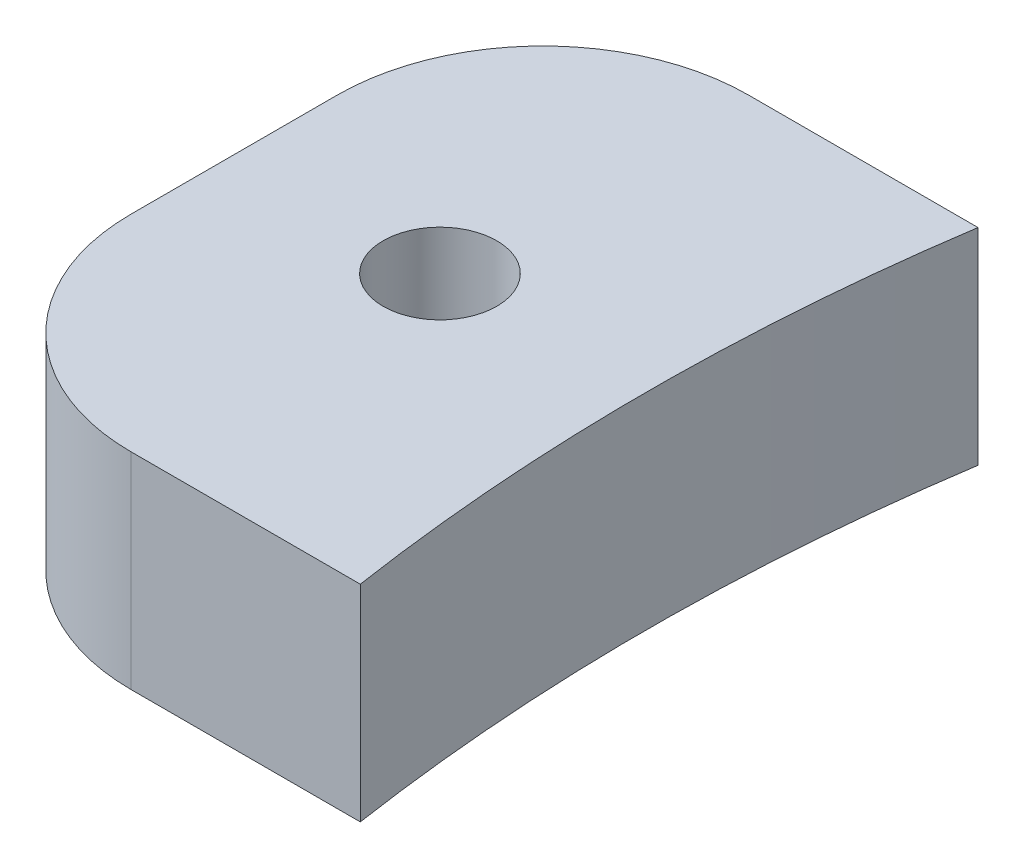
ISO-10303-21;
HEADER;
FILE_DESCRIPTION(('STEP AP214'),'2;1');
FILE_NAME('part.step','',(''),(''),'','','');
FILE_SCHEMA(('AUTOMOTIVE_DESIGN { 1 0 10303 214 1 1 1 1 }'));
ENDSEC;
DATA;
#1=APPLICATION_CONTEXT('core data for automotive mechanical design processes');
#2=APPLICATION_PROTOCOL_DEFINITION('international standard','automotive_design',2000,#1);
#3=PRODUCT_CONTEXT('',#1,'mechanical');
#4=PRODUCT('Part','Part','',(#3));
#5=PRODUCT_RELATED_PRODUCT_CATEGORY('part','',(#4));
#6=PRODUCT_DEFINITION_FORMATION('','',#4);
#7=PRODUCT_DEFINITION_CONTEXT('part definition',#1,'design');
#8=PRODUCT_DEFINITION('design','',#6,#7);
#9=PRODUCT_DEFINITION_SHAPE('','',#8);
#10=(LENGTH_UNIT() NAMED_UNIT(*) SI_UNIT(.MILLI.,.METRE.));
#11=(NAMED_UNIT(*) PLANE_ANGLE_UNIT() SI_UNIT($,.RADIAN.));
#12=(NAMED_UNIT(*) SI_UNIT($,.STERADIAN.) SOLID_ANGLE_UNIT());
#13=UNCERTAINTY_MEASURE_WITH_UNIT(LENGTH_MEASURE(1.E-05),#10,'distance_accuracy_value','');
#14=(GEOMETRIC_REPRESENTATION_CONTEXT(3) GLOBAL_UNCERTAINTY_ASSIGNED_CONTEXT((#13)) GLOBAL_UNIT_ASSIGNED_CONTEXT((#10,
#11,#12)) REPRESENTATION_CONTEXT('',''));
#15=CARTESIAN_POINT('',(0.,0.,0.));
#16=DIRECTION('',(0.,0.,1.));
#17=DIRECTION('',(1.,0.,0.));
#18=AXIS2_PLACEMENT_3D('',#15,#16,#17);
#19=CARTESIAN_POINT('',(-69.85,6.35,-9.525));
#20=DIRECTION('',(0.,0.,1.));
#21=DIRECTION('',(1.,0.,0.));
#22=AXIS2_PLACEMENT_3D('',#19,#20,#21);
#23=PLANE('',#22);
#24=DIRECTION('',(-1.,0.,0.));
#25=VECTOR('',#24,1.);
#26=CARTESIAN_POINT('',(-69.85,6.35,-9.525));
#27=LINE('',#26,#25);
#28=CARTESIAN_POINT('',(-62.7815607881805,6.35,-9.525));
#29=VERTEX_POINT('',#28);
#30=CARTESIAN_POINT('',(-69.85,6.35,-9.52499999999998));
#31=VERTEX_POINT('',#30);
#32=EDGE_CURVE('E100',#29,#31,#27,.T.);
#33=ORIENTED_EDGE('',*,*,#32,.F.);
#34=DIRECTION('',(0.,1.,0.));
#35=VECTOR('',#34,1.);
#36=CARTESIAN_POINT('',(-62.7815607881805,0.,-9.525));
#37=LINE('',#36,#35);
#38=CARTESIAN_POINT('',(-62.7815607881805,0.,-9.525));
#39=VERTEX_POINT('',#38);
#40=EDGE_CURVE('E88',#29,#39,#37,.F.);
#41=ORIENTED_EDGE('',*,*,#40,.T.);
#42=DIRECTION('',(-1.,0.,0.));
#43=VECTOR('',#42,1.);
#44=CARTESIAN_POINT('',(-69.85,0.,-9.525));
#45=LINE('',#44,#43);
#46=CARTESIAN_POINT('',(-69.85,0.,-9.52499999999998));
#47=VERTEX_POINT('',#46);
#48=EDGE_CURVE('E99',#39,#47,#45,.T.);
#49=ORIENTED_EDGE('',*,*,#48,.T.);
#50=DIRECTION('',(0.,-1.,0.));
#51=VECTOR('',#50,1.);
#52=CARTESIAN_POINT('',(-69.85,6.35,-9.52499999999998));
#53=LINE('',#52,#51);
#54=EDGE_CURVE('E11',#31,#47,#53,.T.);
#55=ORIENTED_EDGE('',*,*,#54,.F.);
#56=EDGE_LOOP('',(#33,#41,#49,#55));
#57=FACE_BOUND('',#56,.T.);
#58=ADVANCED_FACE('F34',(#57),#23,.F.);
#59=CARTESIAN_POINT('',(-69.85,6.35,-3.175));
#60=DIRECTION('',(0.,-1.,0.));
#61=DIRECTION('',(0.,0.,-1.));
#62=AXIS2_PLACEMENT_3D('',#59,#60,#61);
#63=CYLINDRICAL_SURFACE('',#62,6.34999999999998);
#64=CARTESIAN_POINT('',(-69.85,0.,-3.175));
#65=DIRECTION('',(0.,1.,0.));
#66=DIRECTION('',(0.,0.,1.));
#67=AXIS2_PLACEMENT_3D('',#64,#65,#66);
#68=CIRCLE('',#67,6.34999999999998);
#69=CARTESIAN_POINT('',(-76.2,0.,-3.175));
#70=VERTEX_POINT('',#69);
#71=EDGE_CURVE('E105',#47,#70,#68,.T.);
#72=ORIENTED_EDGE('',*,*,#71,.T.);
#73=DIRECTION('',(0.,-1.,0.));
#74=VECTOR('',#73,1.);
#75=CARTESIAN_POINT('',(-76.2,6.35,-3.175));
#76=LINE('',#75,#74);
#77=CARTESIAN_POINT('',(-76.2,6.35,-3.175));
#78=VERTEX_POINT('',#77);
#79=EDGE_CURVE('E42',#78,#70,#76,.T.);
#80=ORIENTED_EDGE('',*,*,#79,.F.);
#81=CARTESIAN_POINT('',(-69.85,6.35,-3.175));
#82=DIRECTION('',(0.,1.,0.));
#83=DIRECTION('',(0.,0.,1.));
#84=AXIS2_PLACEMENT_3D('',#81,#82,#83);
#85=CIRCLE('',#84,6.34999999999998);
#86=EDGE_CURVE('E117',#31,#78,#85,.T.);
#87=ORIENTED_EDGE('',*,*,#86,.F.);
#88=ORIENTED_EDGE('',*,*,#54,.T.);
#89=EDGE_LOOP('',(#72,#80,#87,#88));
#90=FACE_BOUND('',#89,.T.);
#91=ADVANCED_FACE('F164',(#90),#63,.T.);
#92=CARTESIAN_POINT('',(-76.2,6.35,-3.175));
#93=DIRECTION('',(1.,0.,0.));
#94=DIRECTION('',(0.,0.,-1.));
#95=AXIS2_PLACEMENT_3D('',#92,#93,#94);
#96=PLANE('',#95);
#97=DIRECTION('',(0.,0.,1.));
#98=VECTOR('',#97,1.);
#99=CARTESIAN_POINT('',(-76.2,0.,-3.175));
#100=LINE('',#99,#98);
#101=CARTESIAN_POINT('',(-76.2,0.,3.175));
#102=VERTEX_POINT('',#101);
#103=EDGE_CURVE('E107',#70,#102,#100,.T.);
#104=ORIENTED_EDGE('',*,*,#103,.T.);
#105=DIRECTION('',(0.,-1.,0.));
#106=VECTOR('',#105,1.);
#107=CARTESIAN_POINT('',(-76.2,6.35,3.175));
#108=LINE('',#107,#106);
#109=CARTESIAN_POINT('',(-76.2,6.35,3.175));
#110=VERTEX_POINT('',#109);
#111=EDGE_CURVE('E127',#110,#102,#108,.T.);
#112=ORIENTED_EDGE('',*,*,#111,.F.);
#113=DIRECTION('',(0.,0.,1.));
#114=VECTOR('',#113,1.);
#115=CARTESIAN_POINT('',(-76.2,6.35,-3.175));
#116=LINE('',#115,#114);
#117=EDGE_CURVE('E119',#78,#110,#116,.T.);
#118=ORIENTED_EDGE('',*,*,#117,.F.);
#119=ORIENTED_EDGE('',*,*,#79,.T.);
#120=EDGE_LOOP('',(#104,#112,#118,#119));
#121=FACE_BOUND('',#120,.T.);
#122=ADVANCED_FACE('F134',(#121),#96,.F.);
#123=CARTESIAN_POINT('',(-69.85,6.35,3.175));
#124=DIRECTION('',(0.,-1.,0.));
#125=DIRECTION('',(0.,0.,-1.));
#126=AXIS2_PLACEMENT_3D('',#123,#124,#125);
#127=CYLINDRICAL_SURFACE('',#126,6.34999999999998);
#128=CARTESIAN_POINT('',(-69.85,0.,3.175));
#129=DIRECTION('',(0.,1.,0.));
#130=DIRECTION('',(0.,0.,-1.));
#131=AXIS2_PLACEMENT_3D('',#128,#129,#130);
#132=CIRCLE('',#131,6.34999999999998);
#133=CARTESIAN_POINT('',(-69.85,0.,9.525));
#134=VERTEX_POINT('',#133);
#135=EDGE_CURVE('E112',#102,#134,#132,.T.);
#136=ORIENTED_EDGE('',*,*,#135,.T.);
#137=DIRECTION('',(0.,-1.,0.));
#138=VECTOR('',#137,1.);
#139=CARTESIAN_POINT('',(-69.85,6.35,9.525));
#140=LINE('',#139,#138);
#141=CARTESIAN_POINT('',(-69.85,6.35,9.525));
#142=VERTEX_POINT('',#141);
#143=EDGE_CURVE('E124',#142,#134,#140,.T.);
#144=ORIENTED_EDGE('',*,*,#143,.F.);
#145=CARTESIAN_POINT('',(-69.85,6.35,3.175));
#146=DIRECTION('',(0.,1.,0.));
#147=DIRECTION('',(0.,0.,-1.));
#148=AXIS2_PLACEMENT_3D('',#145,#146,#147);
#149=CIRCLE('',#148,6.34999999999998);
#150=EDGE_CURVE('E57',#110,#142,#149,.T.);
#151=ORIENTED_EDGE('',*,*,#150,.F.);
#152=ORIENTED_EDGE('',*,*,#111,.T.);
#153=EDGE_LOOP('',(#136,#144,#151,#152));
#154=FACE_BOUND('',#153,.T.);
#155=ADVANCED_FACE('F140',(#154),#127,.T.);
#156=CARTESIAN_POINT('',(-69.85,6.35,9.525));
#157=DIRECTION('',(0.,0.,-1.));
#158=DIRECTION('',(-1.,0.,0.));
#159=AXIS2_PLACEMENT_3D('',#156,#157,#158);
#160=PLANE('',#159);
#161=DIRECTION('',(1.,0.,0.));
#162=VECTOR('',#161,1.);
#163=CARTESIAN_POINT('',(-69.85,0.,9.525));
#164=LINE('',#163,#162);
#165=CARTESIAN_POINT('',(-62.7815607881805,0.,9.525));
#166=VERTEX_POINT('',#165);
#167=EDGE_CURVE('E114',#134,#166,#164,.T.);
#168=ORIENTED_EDGE('',*,*,#167,.T.);
#169=DIRECTION('',(0.,1.,0.));
#170=VECTOR('',#169,1.);
#171=CARTESIAN_POINT('',(-62.7815607881805,0.,9.525));
#172=LINE('',#171,#170);
#173=CARTESIAN_POINT('',(-62.7815607881805,6.35,9.525));
#174=VERTEX_POINT('',#173);
#175=EDGE_CURVE('E49',#166,#174,#172,.T.);
#176=ORIENTED_EDGE('',*,*,#175,.T.);
#177=DIRECTION('',(1.,0.,0.));
#178=VECTOR('',#177,1.);
#179=CARTESIAN_POINT('',(-69.85,6.35,9.525));
#180=LINE('',#179,#178);
#181=EDGE_CURVE('E122',#142,#174,#180,.T.);
#182=ORIENTED_EDGE('',*,*,#181,.F.);
#183=ORIENTED_EDGE('',*,*,#143,.T.);
#184=EDGE_LOOP('',(#168,#176,#182,#183));
#185=FACE_BOUND('',#184,.T.);
#186=ADVANCED_FACE('F143',(#185),#160,.F.);
#187=CARTESIAN_POINT('',(-69.85,6.35,3.175));
#188=DIRECTION('',(0.,-1.,0.));
#189=DIRECTION('',(0.,0.,-1.));
#190=AXIS2_PLACEMENT_3D('',#187,#188,#189);
#191=PLANE('',#190);
#192=CARTESIAN_POINT('',(-69.85,6.35000000000012,0.));
#193=DIRECTION('',(0.,1.,0.));
#194=DIRECTION('',(0.,0.,1.));
#195=AXIS2_PLACEMENT_3D('',#192,#193,#194);
#196=CIRCLE('',#195,1.7526000000001);
#197=CARTESIAN_POINT('',(-69.85,6.35000000000012,1.75260000000011));
#198=VERTEX_POINT('',#197);
#199=EDGE_CURVE('E147',#198,#198,#196,.T.);
#200=ORIENTED_EDGE('',*,*,#199,.F.);
#201=EDGE_LOOP('',(#200));
#202=FACE_BOUND('',#201,.T.);
#203=ORIENTED_EDGE('',*,*,#181,.T.);
#204=CARTESIAN_POINT('',(0.,6.35,0.));
#205=DIRECTION('',(0.,1.,0.));
#206=DIRECTION('',(0.,0.,1.));
#207=AXIS2_PLACEMENT_3D('',#204,#205,#206);
#208=CIRCLE('',#207,63.5);
#209=EDGE_CURVE('E94',#29,#174,#208,.T.);
#210=ORIENTED_EDGE('',*,*,#209,.F.);
#211=ORIENTED_EDGE('',*,*,#32,.T.);
#212=ORIENTED_EDGE('',*,*,#86,.T.);
#213=ORIENTED_EDGE('',*,*,#117,.T.);
#214=ORIENTED_EDGE('',*,*,#150,.T.);
#215=EDGE_LOOP('',(#203,#210,#211,#212,#213,#214));
#216=FACE_BOUND('',#215,.T.);
#217=ADVANCED_FACE('F144',(#202,#216),#191,.F.);
#218=CARTESIAN_POINT('',(-69.85,0.,3.175));
#219=DIRECTION('',(0.,-1.,0.));
#220=DIRECTION('',(0.,0.,-1.));
#221=AXIS2_PLACEMENT_3D('',#218,#219,#220);
#222=PLANE('',#221);
#223=CARTESIAN_POINT('',(-69.85,0.,0.));
#224=DIRECTION('',(0.,-1.,0.));
#225=DIRECTION('',(0.,0.,-1.));
#226=AXIS2_PLACEMENT_3D('',#223,#224,#225);
#227=CIRCLE('',#226,1.75260000000005);
#228=CARTESIAN_POINT('',(-69.85,0.,-1.75260000000005));
#229=VERTEX_POINT('',#228);
#230=EDGE_CURVE('E37',#229,#229,#227,.T.);
#231=ORIENTED_EDGE('',*,*,#230,.F.);
#232=EDGE_LOOP('',(#231));
#233=FACE_BOUND('',#232,.T.);
#234=CARTESIAN_POINT('',(0.,0.,0.));
#235=DIRECTION('',(0.,1.,0.));
#236=DIRECTION('',(0.,0.,1.));
#237=AXIS2_PLACEMENT_3D('',#234,#235,#236);
#238=CIRCLE('',#237,63.5);
#239=EDGE_CURVE('E85',#39,#166,#238,.T.);
#240=ORIENTED_EDGE('',*,*,#239,.T.);
#241=ORIENTED_EDGE('',*,*,#167,.F.);
#242=ORIENTED_EDGE('',*,*,#135,.F.);
#243=ORIENTED_EDGE('',*,*,#103,.F.);
#244=ORIENTED_EDGE('',*,*,#71,.F.);
#245=ORIENTED_EDGE('',*,*,#48,.F.);
#246=EDGE_LOOP('',(#240,#241,#242,#243,#244,#245));
#247=FACE_BOUND('',#246,.T.);
#248=ADVANCED_FACE('F103',(#233,#247),#222,.T.);
#249=CARTESIAN_POINT('',(0.,0.,0.));
#250=DIRECTION('',(0.,1.,0.));
#251=DIRECTION('',(0.,0.,1.));
#252=AXIS2_PLACEMENT_3D('',#249,#250,#251);
#253=CYLINDRICAL_SURFACE('',#252,63.5);
#254=ORIENTED_EDGE('',*,*,#209,.T.);
#255=ORIENTED_EDGE('',*,*,#175,.F.);
#256=ORIENTED_EDGE('',*,*,#239,.F.);
#257=ORIENTED_EDGE('',*,*,#40,.F.);
#258=EDGE_LOOP('',(#254,#255,#256,#257));
#259=FACE_BOUND('',#258,.T.);
#260=ADVANCED_FACE('F87',(#259),#253,.F.);
#261=CARTESIAN_POINT('',(-69.85,6.35,0.));
#262=DIRECTION('',(0.,1.,0.));
#263=DIRECTION('',(0.,0.,1.));
#264=AXIS2_PLACEMENT_3D('',#261,#262,#263);
#265=CYLINDRICAL_SURFACE('',#264,1.75260000000005);
#266=ORIENTED_EDGE('',*,*,#230,.T.);
#267=EDGE_LOOP('',(#266));
#268=FACE_BOUND('',#267,.T.);
#269=ORIENTED_EDGE('',*,*,#199,.T.);
#270=EDGE_LOOP('',(#269));
#271=FACE_BOUND('',#270,.T.);
#272=ADVANCED_FACE('F152',(#268,#271),#265,.F.);
#273=CLOSED_SHELL('',(#58,#91,#122,#155,#186,#217,#248,#260,#272));
#274=MANIFOLD_SOLID_BREP('B2',#273);
#275=ADVANCED_BREP_SHAPE_REPRESENTATION('',(#18,#274),#14);
#276=SHAPE_DEFINITION_REPRESENTATION(#9,#275);
ENDSEC;
END-ISO-10303-21;
